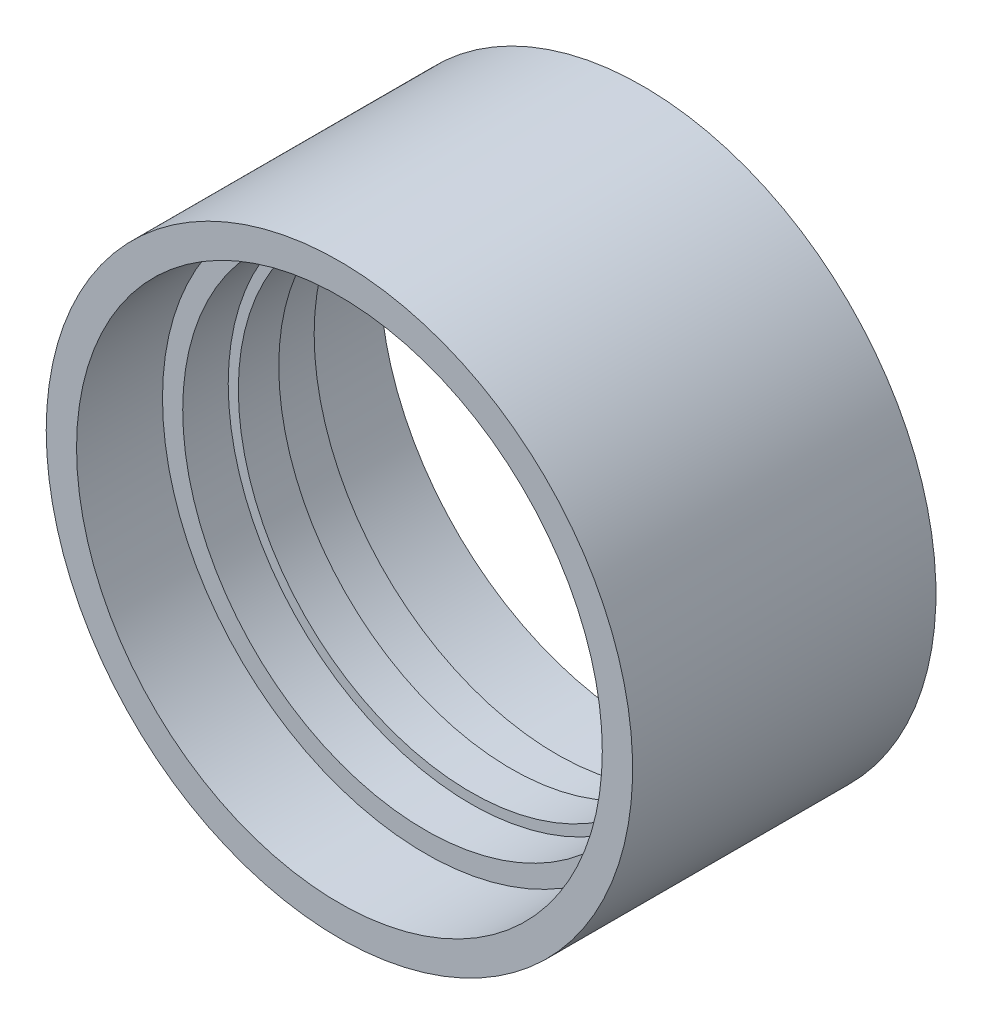
ISO-10303-21;
HEADER;
FILE_DESCRIPTION(('STEP AP214'),'2;1');
FILE_NAME('part.step','',(''),(''),'','','');
FILE_SCHEMA(('AUTOMOTIVE_DESIGN { 1 0 10303 214 1 1 1 1 }'));
ENDSEC;
DATA;
#1=APPLICATION_CONTEXT('core data for automotive mechanical design processes');
#2=APPLICATION_PROTOCOL_DEFINITION('international standard','automotive_design',2000,#1);
#3=PRODUCT_CONTEXT('',#1,'mechanical');
#4=PRODUCT('Part','Part','',(#3));
#5=PRODUCT_RELATED_PRODUCT_CATEGORY('part','',(#4));
#6=PRODUCT_DEFINITION_FORMATION('','',#4);
#7=PRODUCT_DEFINITION_CONTEXT('part definition',#1,'design');
#8=PRODUCT_DEFINITION('design','',#6,#7);
#9=PRODUCT_DEFINITION_SHAPE('','',#8);
#10=(LENGTH_UNIT() NAMED_UNIT(*) SI_UNIT(.MILLI.,.METRE.));
#11=(NAMED_UNIT(*) PLANE_ANGLE_UNIT() SI_UNIT($,.RADIAN.));
#12=(NAMED_UNIT(*) SI_UNIT($,.STERADIAN.) SOLID_ANGLE_UNIT());
#13=UNCERTAINTY_MEASURE_WITH_UNIT(LENGTH_MEASURE(1.E-05),#10,'distance_accuracy_value','');
#14=(GEOMETRIC_REPRESENTATION_CONTEXT(3) GLOBAL_UNCERTAINTY_ASSIGNED_CONTEXT((#13)) GLOBAL_UNIT_ASSIGNED_CONTEXT((#10,
#11,#12)) REPRESENTATION_CONTEXT('',''));
#15=CARTESIAN_POINT('',(0.,0.,0.));
#16=DIRECTION('',(0.,0.,1.));
#17=DIRECTION('',(1.,0.,0.));
#18=AXIS2_PLACEMENT_3D('',#15,#16,#17);
#19=CARTESIAN_POINT('',(0.,26.,15.));
#20=DIRECTION('',(0.,0.,1.));
#21=DIRECTION('',(1.,0.,0.));
#22=AXIS2_PLACEMENT_3D('',#19,#20,#21);
#23=PLANE('',#22);
#24=CARTESIAN_POINT('',(0.,0.,15.));
#25=DIRECTION('',(0.,0.,-1.));
#26=DIRECTION('',(-1.,0.,0.));
#27=AXIS2_PLACEMENT_3D('',#24,#25,#26);
#28=CIRCLE('',#27,26.);
#29=CARTESIAN_POINT('',(-26.,0.,15.));
#30=VERTEX_POINT('',#29);
#31=EDGE_CURVE('E73',#30,#30,#28,.T.);
#32=ORIENTED_EDGE('',*,*,#31,.T.);
#33=EDGE_LOOP('',(#32));
#34=FACE_BOUND('',#33,.T.);
#35=CARTESIAN_POINT('',(0.,0.,15.));
#36=DIRECTION('',(0.,0.,-1.));
#37=DIRECTION('',(-1.,0.,0.));
#38=AXIS2_PLACEMENT_3D('',#35,#36,#37);
#39=CIRCLE('',#38,29.);
#40=CARTESIAN_POINT('',(-29.,0.,15.));
#41=VERTEX_POINT('',#40);
#42=EDGE_CURVE('E10',#41,#41,#39,.T.);
#43=ORIENTED_EDGE('',*,*,#42,.F.);
#44=EDGE_LOOP('',(#43));
#45=FACE_BOUND('',#44,.T.);
#46=ADVANCED_FACE('F33',(#34,#45),#23,.T.);
#47=CARTESIAN_POINT('',(0.,0.,-12.1292172554568));
#48=DIRECTION('',(0.,0.,-1.));
#49=DIRECTION('',(-1.,0.,0.));
#50=AXIS2_PLACEMENT_3D('',#47,#48,#49);
#51=CYLINDRICAL_SURFACE('',#50,29.);
#52=ORIENTED_EDGE('',*,*,#42,.T.);
#53=EDGE_LOOP('',(#52));
#54=FACE_BOUND('',#53,.T.);
#55=CARTESIAN_POINT('',(0.,0.,-15.));
#56=DIRECTION('',(0.,0.,-1.));
#57=DIRECTION('',(-1.,0.,0.));
#58=AXIS2_PLACEMENT_3D('',#55,#56,#57);
#59=CIRCLE('',#58,29.);
#60=CARTESIAN_POINT('',(-29.,0.,-15.));
#61=VERTEX_POINT('',#60);
#62=EDGE_CURVE('E39',#61,#61,#59,.T.);
#63=ORIENTED_EDGE('',*,*,#62,.F.);
#64=EDGE_LOOP('',(#63));
#65=FACE_BOUND('',#64,.T.);
#66=ADVANCED_FACE('F91',(#54,#65),#51,.T.);
#67=CARTESIAN_POINT('',(0.,29.,-15.));
#68=DIRECTION('',(0.,0.,-1.));
#69=DIRECTION('',(-1.,0.,0.));
#70=AXIS2_PLACEMENT_3D('',#67,#68,#69);
#71=PLANE('',#70);
#72=ORIENTED_EDGE('',*,*,#62,.T.);
#73=EDGE_LOOP('',(#72));
#74=FACE_BOUND('',#73,.T.);
#75=CARTESIAN_POINT('',(0.,0.,-15.));
#76=DIRECTION('',(0.,0.,-1.));
#77=DIRECTION('',(-1.,0.,0.));
#78=AXIS2_PLACEMENT_3D('',#75,#76,#77);
#79=CIRCLE('',#78,26.);
#80=CARTESIAN_POINT('',(-26.,0.,-15.));
#81=VERTEX_POINT('',#80);
#82=EDGE_CURVE('E43',#81,#81,#79,.T.);
#83=ORIENTED_EDGE('',*,*,#82,.F.);
#84=EDGE_LOOP('',(#83));
#85=FACE_BOUND('',#84,.T.);
#86=ADVANCED_FACE('F95',(#74,#85),#71,.T.);
#87=CARTESIAN_POINT('',(0.,0.,-12.1292172554568));
#88=DIRECTION('',(0.,0.,-1.));
#89=DIRECTION('',(-1.,0.,0.));
#90=AXIS2_PLACEMENT_3D('',#87,#88,#89);
#91=CYLINDRICAL_SURFACE('',#90,26.);
#92=ORIENTED_EDGE('',*,*,#82,.T.);
#93=EDGE_LOOP('',(#92));
#94=FACE_BOUND('',#93,.T.);
#95=CARTESIAN_POINT('',(0.,0.,-6.5));
#96=DIRECTION('',(0.,0.,-1.));
#97=DIRECTION('',(-1.,0.,0.));
#98=AXIS2_PLACEMENT_3D('',#95,#96,#97);
#99=CIRCLE('',#98,26.);
#100=CARTESIAN_POINT('',(-26.,0.,-6.5));
#101=VERTEX_POINT('',#100);
#102=EDGE_CURVE('E47',#101,#101,#99,.T.);
#103=ORIENTED_EDGE('',*,*,#102,.F.);
#104=EDGE_LOOP('',(#103));
#105=FACE_BOUND('',#104,.T.);
#106=ADVANCED_FACE('F99',(#94,#105),#91,.F.);
#107=CARTESIAN_POINT('',(0.,24.,-6.5));
#108=DIRECTION('',(0.,0.,-1.));
#109=DIRECTION('',(-1.,0.,0.));
#110=AXIS2_PLACEMENT_3D('',#107,#108,#109);
#111=PLANE('',#110);
#112=ORIENTED_EDGE('',*,*,#102,.T.);
#113=EDGE_LOOP('',(#112));
#114=FACE_BOUND('',#113,.T.);
#115=CARTESIAN_POINT('',(0.,0.,-6.5));
#116=DIRECTION('',(0.,0.,-1.));
#117=DIRECTION('',(-1.,0.,0.));
#118=AXIS2_PLACEMENT_3D('',#115,#116,#117);
#119=CIRCLE('',#118,24.);
#120=CARTESIAN_POINT('',(-24.,0.,-6.5));
#121=VERTEX_POINT('',#120);
#122=EDGE_CURVE('E52',#121,#121,#119,.T.);
#123=ORIENTED_EDGE('',*,*,#122,.F.);
#124=EDGE_LOOP('',(#123));
#125=FACE_BOUND('',#124,.T.);
#126=ADVANCED_FACE('F105',(#114,#125),#111,.T.);
#127=CARTESIAN_POINT('',(0.,0.,-12.1292172554568));
#128=DIRECTION('',(0.,0.,-1.));
#129=DIRECTION('',(-1.,0.,0.));
#130=AXIS2_PLACEMENT_3D('',#127,#128,#129);
#131=CYLINDRICAL_SURFACE('',#130,24.);
#132=ORIENTED_EDGE('',*,*,#122,.T.);
#133=EDGE_LOOP('',(#132));
#134=FACE_BOUND('',#133,.T.);
#135=CARTESIAN_POINT('',(0.,0.,-2.));
#136=DIRECTION('',(0.,0.,-1.));
#137=DIRECTION('',(-1.,0.,0.));
#138=AXIS2_PLACEMENT_3D('',#135,#136,#137);
#139=CIRCLE('',#138,24.);
#140=CARTESIAN_POINT('',(-24.,0.,-2.));
#141=VERTEX_POINT('',#140);
#142=EDGE_CURVE('E55',#141,#141,#139,.T.);
#143=ORIENTED_EDGE('',*,*,#142,.F.);
#144=EDGE_LOOP('',(#143));
#145=FACE_BOUND('',#144,.T.);
#146=ADVANCED_FACE('F109',(#134,#145),#131,.F.);
#147=CARTESIAN_POINT('',(0.,23.,-2.));
#148=DIRECTION('',(0.,0.,-1.));
#149=DIRECTION('',(-1.,0.,0.));
#150=AXIS2_PLACEMENT_3D('',#147,#148,#149);
#151=PLANE('',#150);
#152=ORIENTED_EDGE('',*,*,#142,.T.);
#153=EDGE_LOOP('',(#152));
#154=FACE_BOUND('',#153,.T.);
#155=CARTESIAN_POINT('',(0.,0.,-2.));
#156=DIRECTION('',(0.,0.,-1.));
#157=DIRECTION('',(-1.,0.,0.));
#158=AXIS2_PLACEMENT_3D('',#155,#156,#157);
#159=CIRCLE('',#158,23.);
#160=CARTESIAN_POINT('',(-23.,0.,-2.));
#161=VERTEX_POINT('',#160);
#162=EDGE_CURVE('E58',#161,#161,#159,.T.);
#163=ORIENTED_EDGE('',*,*,#162,.F.);
#164=EDGE_LOOP('',(#163));
#165=FACE_BOUND('',#164,.T.);
#166=ADVANCED_FACE('F113',(#154,#165),#151,.T.);
#167=CARTESIAN_POINT('',(0.,0.,-12.1292172554568));
#168=DIRECTION('',(0.,0.,-1.));
#169=DIRECTION('',(-1.,0.,0.));
#170=AXIS2_PLACEMENT_3D('',#167,#168,#169);
#171=CYLINDRICAL_SURFACE('',#170,23.);
#172=ORIENTED_EDGE('',*,*,#162,.T.);
#173=EDGE_LOOP('',(#172));
#174=FACE_BOUND('',#173,.T.);
#175=CARTESIAN_POINT('',(0.,0.,2.));
#176=DIRECTION('',(0.,0.,-1.));
#177=DIRECTION('',(-1.,0.,0.));
#178=AXIS2_PLACEMENT_3D('',#175,#176,#177);
#179=CIRCLE('',#178,23.);
#180=CARTESIAN_POINT('',(-23.,0.,2.));
#181=VERTEX_POINT('',#180);
#182=EDGE_CURVE('E61',#181,#181,#179,.T.);
#183=ORIENTED_EDGE('',*,*,#182,.F.);
#184=EDGE_LOOP('',(#183));
#185=FACE_BOUND('',#184,.T.);
#186=ADVANCED_FACE('F117',(#174,#185),#171,.F.);
#187=CARTESIAN_POINT('',(0.,24.,2.));
#188=DIRECTION('',(0.,0.,1.));
#189=DIRECTION('',(1.,0.,0.));
#190=AXIS2_PLACEMENT_3D('',#187,#188,#189);
#191=PLANE('',#190);
#192=ORIENTED_EDGE('',*,*,#182,.T.);
#193=EDGE_LOOP('',(#192));
#194=FACE_BOUND('',#193,.T.);
#195=CARTESIAN_POINT('',(0.,0.,2.));
#196=DIRECTION('',(0.,0.,-1.));
#197=DIRECTION('',(-1.,0.,0.));
#198=AXIS2_PLACEMENT_3D('',#195,#196,#197);
#199=CIRCLE('',#198,24.);
#200=CARTESIAN_POINT('',(-24.,0.,2.));
#201=VERTEX_POINT('',#200);
#202=EDGE_CURVE('E64',#201,#201,#199,.T.);
#203=ORIENTED_EDGE('',*,*,#202,.F.);
#204=EDGE_LOOP('',(#203));
#205=FACE_BOUND('',#204,.T.);
#206=ADVANCED_FACE('F121',(#194,#205),#191,.T.);
#207=CARTESIAN_POINT('',(0.,0.,-12.1292172554568));
#208=DIRECTION('',(0.,0.,-1.));
#209=DIRECTION('',(-1.,0.,0.));
#210=AXIS2_PLACEMENT_3D('',#207,#208,#209);
#211=CYLINDRICAL_SURFACE('',#210,24.);
#212=ORIENTED_EDGE('',*,*,#202,.T.);
#213=EDGE_LOOP('',(#212));
#214=FACE_BOUND('',#213,.T.);
#215=CARTESIAN_POINT('',(0.,0.,6.5));
#216=DIRECTION('',(0.,0.,-1.));
#217=DIRECTION('',(-1.,0.,0.));
#218=AXIS2_PLACEMENT_3D('',#215,#216,#217);
#219=CIRCLE('',#218,24.);
#220=CARTESIAN_POINT('',(-24.,0.,6.5));
#221=VERTEX_POINT('',#220);
#222=EDGE_CURVE('E67',#221,#221,#219,.T.);
#223=ORIENTED_EDGE('',*,*,#222,.F.);
#224=EDGE_LOOP('',(#223));
#225=FACE_BOUND('',#224,.T.);
#226=ADVANCED_FACE('F87',(#214,#225),#211,.F.);
#227=CARTESIAN_POINT('',(0.,26.,6.5));
#228=DIRECTION('',(0.,0.,1.));
#229=DIRECTION('',(1.,0.,0.));
#230=AXIS2_PLACEMENT_3D('',#227,#228,#229);
#231=PLANE('',#230);
#232=ORIENTED_EDGE('',*,*,#222,.T.);
#233=EDGE_LOOP('',(#232));
#234=FACE_BOUND('',#233,.T.);
#235=CARTESIAN_POINT('',(0.,0.,6.5));
#236=DIRECTION('',(0.,0.,-1.));
#237=DIRECTION('',(-1.,0.,0.));
#238=AXIS2_PLACEMENT_3D('',#235,#236,#237);
#239=CIRCLE('',#238,26.);
#240=CARTESIAN_POINT('',(-26.,0.,6.5));
#241=VERTEX_POINT('',#240);
#242=EDGE_CURVE('E70',#241,#241,#239,.T.);
#243=ORIENTED_EDGE('',*,*,#242,.F.);
#244=EDGE_LOOP('',(#243));
#245=FACE_BOUND('',#244,.T.);
#246=ADVANCED_FACE('F81',(#234,#245),#231,.T.);
#247=CARTESIAN_POINT('',(0.,0.,-12.1292172554568));
#248=DIRECTION('',(0.,0.,-1.));
#249=DIRECTION('',(-1.,0.,0.));
#250=AXIS2_PLACEMENT_3D('',#247,#248,#249);
#251=CYLINDRICAL_SURFACE('',#250,26.);
#252=ORIENTED_EDGE('',*,*,#242,.T.);
#253=EDGE_LOOP('',(#252));
#254=FACE_BOUND('',#253,.T.);
#255=ORIENTED_EDGE('',*,*,#31,.F.);
#256=EDGE_LOOP('',(#255));
#257=FACE_BOUND('',#256,.T.);
#258=ADVANCED_FACE('F79',(#254,#257),#251,.F.);
#259=CLOSED_SHELL('',(#46,#66,#86,#106,#126,#146,#166,#186,#206,#226,#246,#258));
#260=MANIFOLD_SOLID_BREP('B2',#259);
#261=ADVANCED_BREP_SHAPE_REPRESENTATION('',(#18,#260),#14);
#262=SHAPE_DEFINITION_REPRESENTATION(#9,#261);
ENDSEC;
END-ISO-10303-21;
